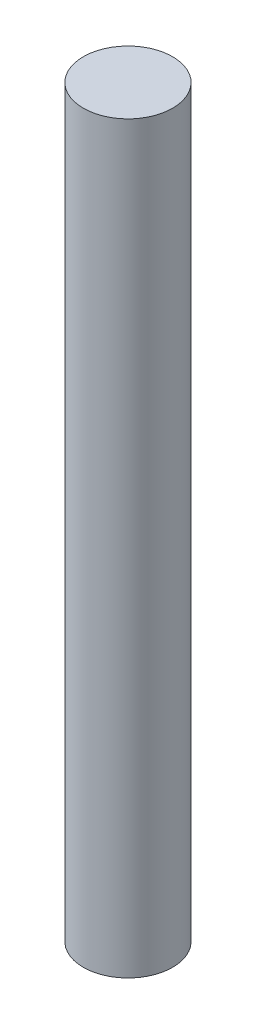
ISO-10303-21;
HEADER;
FILE_DESCRIPTION(('STEP AP214'),'2;1');
FILE_NAME('part.step','',(''),(''),'','','');
FILE_SCHEMA(('AUTOMOTIVE_DESIGN { 1 0 10303 214 1 1 1 1 }'));
ENDSEC;
DATA;
#1=APPLICATION_CONTEXT('core data for automotive mechanical design processes');
#2=APPLICATION_PROTOCOL_DEFINITION('international standard','automotive_design',2000,#1);
#3=PRODUCT_CONTEXT('',#1,'mechanical');
#4=PRODUCT('Part','Part','',(#3));
#5=PRODUCT_RELATED_PRODUCT_CATEGORY('part','',(#4));
#6=PRODUCT_DEFINITION_FORMATION('','',#4);
#7=PRODUCT_DEFINITION_CONTEXT('part definition',#1,'design');
#8=PRODUCT_DEFINITION('design','',#6,#7);
#9=PRODUCT_DEFINITION_SHAPE('','',#8);
#10=(LENGTH_UNIT() NAMED_UNIT(*) SI_UNIT(.MILLI.,.METRE.));
#11=(NAMED_UNIT(*) PLANE_ANGLE_UNIT() SI_UNIT($,.RADIAN.));
#12=(NAMED_UNIT(*) SI_UNIT($,.STERADIAN.) SOLID_ANGLE_UNIT());
#13=UNCERTAINTY_MEASURE_WITH_UNIT(LENGTH_MEASURE(1.E-05),#10,'distance_accuracy_value','');
#14=(GEOMETRIC_REPRESENTATION_CONTEXT(3) GLOBAL_UNCERTAINTY_ASSIGNED_CONTEXT((#13)) GLOBAL_UNIT_ASSIGNED_CONTEXT((#10,
#11,#12)) REPRESENTATION_CONTEXT('',''));
#15=CARTESIAN_POINT('',(0.,0.,0.));
#16=DIRECTION('',(0.,0.,1.));
#17=DIRECTION('',(1.,0.,0.));
#18=AXIS2_PLACEMENT_3D('',#15,#16,#17);
#19=CARTESIAN_POINT('',(0.,100.,0.));
#20=DIRECTION('',(0.,-1.,0.));
#21=DIRECTION('',(0.,0.,-1.));
#22=AXIS2_PLACEMENT_3D('',#19,#20,#21);
#23=CYLINDRICAL_SURFACE('',#22,6.);
#24=CARTESIAN_POINT('',(0.,100.,0.));
#25=DIRECTION('',(0.,1.,0.));
#26=DIRECTION('',(0.,0.,1.));
#27=AXIS2_PLACEMENT_3D('',#24,#25,#26);
#28=CIRCLE('',#27,6.);
#29=CARTESIAN_POINT('',(0.,100.,6.));
#30=VERTEX_POINT('',#29);
#31=EDGE_CURVE('E10',#30,#30,#28,.T.);
#32=ORIENTED_EDGE('',*,*,#31,.F.);
#33=EDGE_LOOP('',(#32));
#34=FACE_BOUND('',#33,.T.);
#35=CARTESIAN_POINT('',(0.,0.,0.));
#36=DIRECTION('',(0.,1.,0.));
#37=DIRECTION('',(0.,0.,1.));
#38=AXIS2_PLACEMENT_3D('',#35,#36,#37);
#39=CIRCLE('',#38,6.);
#40=CARTESIAN_POINT('',(0.,0.,6.));
#41=VERTEX_POINT('',#40);
#42=EDGE_CURVE('E34',#41,#41,#39,.T.);
#43=ORIENTED_EDGE('',*,*,#42,.T.);
#44=EDGE_LOOP('',(#43));
#45=FACE_BOUND('',#44,.T.);
#46=ADVANCED_FACE('F31',(#34,#45),#23,.T.);
#47=CARTESIAN_POINT('',(0.,100.,0.));
#48=DIRECTION('',(0.,1.,0.));
#49=DIRECTION('',(0.,0.,1.));
#50=AXIS2_PLACEMENT_3D('',#47,#48,#49);
#51=PLANE('',#50);
#52=ORIENTED_EDGE('',*,*,#31,.T.);
#53=EDGE_LOOP('',(#52));
#54=FACE_BOUND('',#53,.T.);
#55=ADVANCED_FACE('F46',(#54),#51,.T.);
#56=CARTESIAN_POINT('',(0.,0.,0.));
#57=DIRECTION('',(0.,1.,0.));
#58=DIRECTION('',(0.,0.,1.));
#59=AXIS2_PLACEMENT_3D('',#56,#57,#58);
#60=PLANE('',#59);
#61=ORIENTED_EDGE('',*,*,#42,.F.);
#62=EDGE_LOOP('',(#61));
#63=FACE_BOUND('',#62,.T.);
#64=ADVANCED_FACE('F44',(#63),#60,.F.);
#65=CLOSED_SHELL('',(#46,#55,#64));
#66=MANIFOLD_SOLID_BREP('B2',#65);
#67=ADVANCED_BREP_SHAPE_REPRESENTATION('',(#18,#66),#14);
#68=SHAPE_DEFINITION_REPRESENTATION(#9,#67);
ENDSEC;
END-ISO-10303-21;
